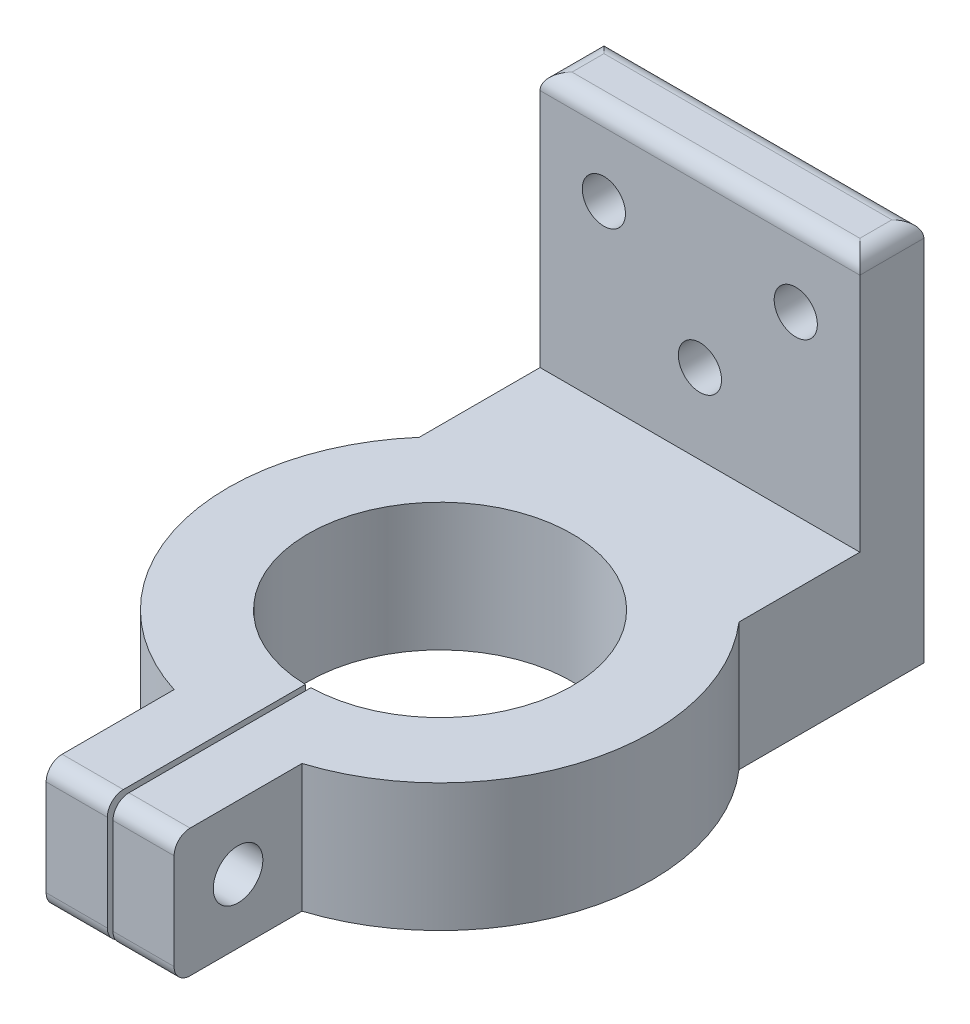
ISO-10303-21;
HEADER;
FILE_DESCRIPTION(('STEP AP214'),'2;1');
FILE_NAME('part.step','',(''),(''),'','','');
FILE_SCHEMA(('AUTOMOTIVE_DESIGN { 1 0 10303 214 1 1 1 1 }'));
ENDSEC;
DATA;
#1=APPLICATION_CONTEXT('core data for automotive mechanical design processes');
#2=APPLICATION_PROTOCOL_DEFINITION('international standard','automotive_design',2000,#1);
#3=PRODUCT_CONTEXT('',#1,'mechanical');
#4=PRODUCT('Part','Part','',(#3));
#5=PRODUCT_RELATED_PRODUCT_CATEGORY('part','',(#4));
#6=PRODUCT_DEFINITION_FORMATION('','',#4);
#7=PRODUCT_DEFINITION_CONTEXT('part definition',#1,'design');
#8=PRODUCT_DEFINITION('design','',#6,#7);
#9=PRODUCT_DEFINITION_SHAPE('','',#8);
#10=(LENGTH_UNIT() NAMED_UNIT(*) SI_UNIT(.MILLI.,.METRE.));
#11=(NAMED_UNIT(*) PLANE_ANGLE_UNIT() SI_UNIT($,.RADIAN.));
#12=(NAMED_UNIT(*) SI_UNIT($,.STERADIAN.) SOLID_ANGLE_UNIT());
#13=UNCERTAINTY_MEASURE_WITH_UNIT(LENGTH_MEASURE(1.E-05),#10,'distance_accuracy_value','');
#14=(GEOMETRIC_REPRESENTATION_CONTEXT(3) GLOBAL_UNCERTAINTY_ASSIGNED_CONTEXT((#13)) GLOBAL_UNIT_ASSIGNED_CONTEXT((#10,
#11,#12)) REPRESENTATION_CONTEXT('',''));
#15=CARTESIAN_POINT('',(0.,0.,0.));
#16=DIRECTION('',(0.,0.,1.));
#17=DIRECTION('',(1.,0.,0.));
#18=AXIS2_PLACEMENT_3D('',#15,#16,#17);
#19=CARTESIAN_POINT('',(-4.,-5.00000000000001,40.8818050966598));
#20=DIRECTION('',(0.,0.,1.));
#21=DIRECTION('',(1.,0.,0.));
#22=AXIS2_PLACEMENT_3D('',#19,#20,#21);
#23=PLANE('',#22);
#24=DIRECTION('',(0.,-1.,0.));
#25=VECTOR('',#24,1.);
#26=CARTESIAN_POINT('',(-4.,-5.00000000000001,40.8818050966598));
#27=LINE('',#26,#25);
#28=CARTESIAN_POINT('',(-4.,-6.00000000000001,40.8818050966598));
#29=VERTEX_POINT('',#28);
#30=CARTESIAN_POINT('',(-4.,-12.,40.8818050966598));
#31=VERTEX_POINT('',#30);
#32=EDGE_CURVE('E306',#29,#31,#27,.T.);
#33=ORIENTED_EDGE('',*,*,#32,.T.);
#34=DIRECTION('',(-1.,0.,0.));
#35=VECTOR('',#34,1.);
#36=CARTESIAN_POINT('',(-0.175000000000003,-12.,40.8818050966598));
#37=LINE('',#36,#35);
#38=CARTESIAN_POINT('',(-0.175000000000004,-12.,40.8818050966598));
#39=VERTEX_POINT('',#38);
#40=EDGE_CURVE('E436',#31,#39,#37,.F.);
#41=ORIENTED_EDGE('',*,*,#40,.T.);
#42=DIRECTION('',(0.,-1.,0.));
#43=VECTOR('',#42,1.);
#44=CARTESIAN_POINT('',(-0.175000000000004,-5.00000000000001,40.8818050966598));
#45=LINE('',#44,#43);
#46=CARTESIAN_POINT('',(-0.175000000000004,-6.00000000000001,40.8818050966598));
#47=VERTEX_POINT('',#46);
#48=EDGE_CURVE('E215',#47,#39,#45,.T.);
#49=ORIENTED_EDGE('',*,*,#48,.F.);
#50=DIRECTION('',(-1.,0.,0.));
#51=VECTOR('',#50,1.);
#52=CARTESIAN_POINT('',(-4.,-6.00000000000001,40.8818050966598));
#53=LINE('',#52,#51);
#54=EDGE_CURVE('E464',#47,#29,#53,.T.);
#55=ORIENTED_EDGE('',*,*,#54,.T.);
#56=EDGE_LOOP('',(#33,#41,#49,#55));
#57=FACE_BOUND('',#56,.T.);
#58=ADVANCED_FACE('F39',(#57),#23,.T.);
#59=CARTESIAN_POINT('',(0.,0.,4.));
#60=DIRECTION('',(0.,0.,1.));
#61=DIRECTION('',(1.,0.,0.));
#62=AXIS2_PLACEMENT_3D('',#59,#60,#61);
#63=PLANE('',#62);
#64=DIRECTION('',(0.,1.,0.));
#65=VECTOR('',#64,1.);
#66=CARTESIAN_POINT('',(10.,11.,4.));
#67=LINE('',#66,#65);
#68=CARTESIAN_POINT('',(10.,-5.00000000000001,4.));
#69=VERTEX_POINT('',#68);
#70=CARTESIAN_POINT('',(10.,9.99999999999999,4.));
#71=VERTEX_POINT('',#70);
#72=EDGE_CURVE('E360',#69,#71,#67,.T.);
#73=ORIENTED_EDGE('',*,*,#72,.T.);
#74=DIRECTION('',(-1.,0.,0.));
#75=VECTOR('',#74,1.);
#76=CARTESIAN_POINT('',(-10.,9.99999999999999,4.));
#77=LINE('',#76,#75);
#78=CARTESIAN_POINT('',(-10.,9.99999999999999,4.));
#79=VERTEX_POINT('',#78);
#80=EDGE_CURVE('E246',#71,#79,#77,.T.);
#81=ORIENTED_EDGE('',*,*,#80,.T.);
#82=DIRECTION('',(0.,-1.,0.));
#83=VECTOR('',#82,1.);
#84=CARTESIAN_POINT('',(-10.,11.,4.));
#85=LINE('',#84,#83);
#86=CARTESIAN_POINT('',(-10.,-5.00000000000001,4.));
#87=VERTEX_POINT('',#86);
#88=EDGE_CURVE('E357',#79,#87,#85,.T.);
#89=ORIENTED_EDGE('',*,*,#88,.T.);
#90=DIRECTION('',(-1.,0.,0.));
#91=VECTOR('',#90,1.);
#92=CARTESIAN_POINT('',(-10.,-5.00000000000001,4.));
#93=LINE('',#92,#91);
#94=EDGE_CURVE('E321',#69,#87,#93,.T.);
#95=ORIENTED_EDGE('',*,*,#94,.F.);
#96=EDGE_LOOP('',(#73,#81,#89,#95));
#97=FACE_BOUND('',#96,.T.);
#98=CARTESIAN_POINT('',(0.,0.,4.));
#99=DIRECTION('',(0.,0.,1.));
#100=DIRECTION('',(1.,0.,0.));
#101=AXIS2_PLACEMENT_3D('',#98,#99,#100);
#102=CIRCLE('',#101,1.35000000000001);
#103=CARTESIAN_POINT('',(1.35000000000001,0.,4.));
#104=VERTEX_POINT('',#103);
#105=EDGE_CURVE('E341',#104,#104,#102,.T.);
#106=ORIENTED_EDGE('',*,*,#105,.F.);
#107=EDGE_LOOP('',(#106));
#108=FACE_BOUND('',#107,.T.);
#109=CARTESIAN_POINT('',(5.99199679743745,5.99999999999999,4.));
#110=DIRECTION('',(0.,0.,1.));
#111=DIRECTION('',(1.,0.,0.));
#112=AXIS2_PLACEMENT_3D('',#109,#110,#111);
#113=CIRCLE('',#112,1.35000000000001);
#114=CARTESIAN_POINT('',(7.34199679743746,5.99999999999999,4.));
#115=VERTEX_POINT('',#114);
#116=EDGE_CURVE('E349',#115,#115,#113,.T.);
#117=ORIENTED_EDGE('',*,*,#116,.F.);
#118=EDGE_LOOP('',(#117));
#119=FACE_BOUND('',#118,.T.);
#120=CARTESIAN_POINT('',(-6.00800320256255,5.99999999999999,4.));
#121=DIRECTION('',(0.,0.,1.));
#122=DIRECTION('',(1.,0.,0.));
#123=AXIS2_PLACEMENT_3D('',#120,#121,#122);
#124=CIRCLE('',#123,1.35);
#125=CARTESIAN_POINT('',(-4.65800320256254,5.99999999999999,4.));
#126=VERTEX_POINT('',#125);
#127=EDGE_CURVE('E333',#126,#126,#124,.T.);
#128=ORIENTED_EDGE('',*,*,#127,.F.);
#129=EDGE_LOOP('',(#128));
#130=FACE_BOUND('',#129,.T.);
#131=ADVANCED_FACE('F510',(#97,#108,#119,#130),#63,.T.);
#132=CARTESIAN_POINT('',(0.,0.,0.));
#133=DIRECTION('',(0.,0.,1.));
#134=DIRECTION('',(1.,0.,0.));
#135=AXIS2_PLACEMENT_3D('',#132,#133,#134);
#136=PLANE('',#135);
#137=DIRECTION('',(0.,-1.,0.));
#138=VECTOR('',#137,1.);
#139=CARTESIAN_POINT('',(-10.,11.,0.));
#140=LINE('',#139,#138);
#141=CARTESIAN_POINT('',(-10.,9.99999999999999,0.));
#142=VERTEX_POINT('',#141);
#143=CARTESIAN_POINT('',(-10.,-13.,0.));
#144=VERTEX_POINT('',#143);
#145=EDGE_CURVE('E353',#142,#144,#140,.T.);
#146=ORIENTED_EDGE('',*,*,#145,.F.);
#147=DIRECTION('',(-1.,0.,0.));
#148=VECTOR('',#147,1.);
#149=CARTESIAN_POINT('',(0.,9.99999999999999,0.));
#150=LINE('',#149,#148);
#151=CARTESIAN_POINT('',(10.,9.99999999999999,0.));
#152=VERTEX_POINT('',#151);
#153=EDGE_CURVE('E252',#142,#152,#150,.F.);
#154=ORIENTED_EDGE('',*,*,#153,.T.);
#155=DIRECTION('',(0.,1.,0.));
#156=VECTOR('',#155,1.);
#157=CARTESIAN_POINT('',(10.,11.,0.));
#158=LINE('',#157,#156);
#159=CARTESIAN_POINT('',(10.,-13.,0.));
#160=VERTEX_POINT('',#159);
#161=EDGE_CURVE('E361',#160,#152,#158,.T.);
#162=ORIENTED_EDGE('',*,*,#161,.F.);
#163=DIRECTION('',(1.,0.,0.));
#164=VECTOR('',#163,1.);
#165=CARTESIAN_POINT('',(-10.,-13.,0.));
#166=LINE('',#165,#164);
#167=EDGE_CURVE('E368',#144,#160,#166,.T.);
#168=ORIENTED_EDGE('',*,*,#167,.F.);
#169=EDGE_LOOP('',(#146,#154,#162,#168));
#170=FACE_BOUND('',#169,.T.);
#171=CARTESIAN_POINT('',(5.99199679743745,5.99999999999999,0.));
#172=DIRECTION('',(0.,0.,1.));
#173=DIRECTION('',(1.,0.,0.));
#174=AXIS2_PLACEMENT_3D('',#171,#172,#173);
#175=CIRCLE('',#174,1.35000000000001);
#176=CARTESIAN_POINT('',(7.34199679743746,5.99999999999999,0.));
#177=VERTEX_POINT('',#176);
#178=EDGE_CURVE('E345',#177,#177,#175,.T.);
#179=ORIENTED_EDGE('',*,*,#178,.T.);
#180=EDGE_LOOP('',(#179));
#181=FACE_BOUND('',#180,.T.);
#182=CARTESIAN_POINT('',(0.,0.,0.));
#183=DIRECTION('',(0.,0.,1.));
#184=DIRECTION('',(1.,0.,0.));
#185=AXIS2_PLACEMENT_3D('',#182,#183,#184);
#186=CIRCLE('',#185,1.35000000000001);
#187=CARTESIAN_POINT('',(1.35000000000001,0.,0.));
#188=VERTEX_POINT('',#187);
#189=EDGE_CURVE('E337',#188,#188,#186,.T.);
#190=ORIENTED_EDGE('',*,*,#189,.T.);
#191=EDGE_LOOP('',(#190));
#192=FACE_BOUND('',#191,.T.);
#193=CARTESIAN_POINT('',(-6.00800320256255,5.99999999999999,0.));
#194=DIRECTION('',(0.,0.,1.));
#195=DIRECTION('',(1.,0.,0.));
#196=AXIS2_PLACEMENT_3D('',#193,#194,#195);
#197=CIRCLE('',#196,1.35);
#198=CARTESIAN_POINT('',(-4.65800320256254,5.99999999999999,0.));
#199=VERTEX_POINT('',#198);
#200=EDGE_CURVE('E332',#199,#199,#197,.T.);
#201=ORIENTED_EDGE('',*,*,#200,.T.);
#202=EDGE_LOOP('',(#201));
#203=FACE_BOUND('',#202,.T.);
#204=ADVANCED_FACE('F389',(#170,#181,#192,#203),#136,.F.);
#205=CARTESIAN_POINT('',(-10.,11.,4.));
#206=DIRECTION('',(1.,0.,0.));
#207=DIRECTION('',(0.,1.,0.));
#208=AXIS2_PLACEMENT_3D('',#205,#206,#207);
#209=PLANE('',#208);
#210=ORIENTED_EDGE('',*,*,#88,.F.);
#211=DIRECTION('',(0.,0.,-1.));
#212=VECTOR('',#211,1.);
#213=CARTESIAN_POINT('',(-10.,9.99999999999999,4.));
#214=LINE('',#213,#212);
#215=EDGE_CURVE('E249',#79,#142,#214,.T.);
#216=ORIENTED_EDGE('',*,*,#215,.T.);
#217=ORIENTED_EDGE('',*,*,#145,.T.);
#218=DIRECTION('',(0.,0.,-1.));
#219=VECTOR('',#218,1.);
#220=CARTESIAN_POINT('',(-10.,-13.,4.));
#221=LINE('',#220,#219);
#222=CARTESIAN_POINT('',(-10.,-13.,11.5573306746431));
#223=VERTEX_POINT('',#222);
#224=EDGE_CURVE('E232',#223,#144,#221,.T.);
#225=ORIENTED_EDGE('',*,*,#224,.F.);
#226=DIRECTION('',(0.,-1.,0.));
#227=VECTOR('',#226,1.);
#228=CARTESIAN_POINT('',(-10.,-5.00000000000001,11.5573306746431));
#229=LINE('',#228,#227);
#230=CARTESIAN_POINT('',(-10.,-5.00000000000001,11.5573306746431));
#231=VERTEX_POINT('',#230);
#232=EDGE_CURVE('E318',#223,#231,#229,.F.);
#233=ORIENTED_EDGE('',*,*,#232,.T.);
#234=DIRECTION('',(0.,0.,-1.));
#235=VECTOR('',#234,1.);
#236=CARTESIAN_POINT('',(-10.,-5.00000000000001,12.));
#237=LINE('',#236,#235);
#238=EDGE_CURVE('E325',#231,#87,#237,.T.);
#239=ORIENTED_EDGE('',*,*,#238,.T.);
#240=EDGE_LOOP('',(#210,#216,#217,#225,#233,#239));
#241=FACE_BOUND('',#240,.T.);
#242=ADVANCED_FACE('F506',(#241),#209,.F.);
#243=CARTESIAN_POINT('',(-10.,-13.,4.));
#244=DIRECTION('',(0.,1.,0.));
#245=DIRECTION('',(0.,0.,1.));
#246=AXIS2_PLACEMENT_3D('',#243,#244,#245);
#247=PLANE('',#246);
#248=DIRECTION('',(0.,0.,-1.));
#249=VECTOR('',#248,1.);
#250=CARTESIAN_POINT('',(-0.175000000000004,-13.,28.4981437305614));
#251=LINE('',#250,#249);
#252=CARTESIAN_POINT('',(-0.175000000000004,-13.,39.8818050966598));
#253=VERTEX_POINT('',#252);
#254=CARTESIAN_POINT('',(-0.175000000000022,-13.,28.4981437305614));
#255=VERTEX_POINT('',#254);
#256=EDGE_CURVE('E198',#253,#255,#251,.T.);
#257=ORIENTED_EDGE('',*,*,#256,.F.);
#258=DIRECTION('',(-1.,0.,0.));
#259=VECTOR('',#258,1.);
#260=CARTESIAN_POINT('',(-4.,-13.,39.8818050966598));
#261=LINE('',#260,#259);
#262=CARTESIAN_POINT('',(-4.,-13.,39.8818050966598));
#263=VERTEX_POINT('',#262);
#264=EDGE_CURVE('E472',#253,#263,#261,.T.);
#265=ORIENTED_EDGE('',*,*,#264,.T.);
#266=DIRECTION('',(0.,0.,-1.));
#267=VECTOR('',#266,1.);
#268=CARTESIAN_POINT('',(-4.,-13.,32.8818050966598));
#269=LINE('',#268,#267);
#270=CARTESIAN_POINT('',(-4.,-13.,32.8818050966598));
#271=VERTEX_POINT('',#270);
#272=EDGE_CURVE('E298',#263,#271,#269,.T.);
#273=ORIENTED_EDGE('',*,*,#272,.T.);
#274=CARTESIAN_POINT('',(0.,-13.,20.25));
#275=DIRECTION('',(0.,-1.,0.));
#276=DIRECTION('',(0.,0.,-1.));
#277=AXIS2_PLACEMENT_3D('',#274,#275,#276);
#278=CIRCLE('',#277,13.25);
#279=EDGE_CURVE('E213',#271,#223,#278,.T.);
#280=ORIENTED_EDGE('',*,*,#279,.T.);
#281=ORIENTED_EDGE('',*,*,#224,.T.);
#282=ORIENTED_EDGE('',*,*,#167,.T.);
#283=DIRECTION('',(0.,0.,-1.));
#284=VECTOR('',#283,1.);
#285=CARTESIAN_POINT('',(10.,-13.,4.));
#286=LINE('',#285,#284);
#287=CARTESIAN_POINT('',(10.,-13.,11.5573306746431));
#288=VERTEX_POINT('',#287);
#289=EDGE_CURVE('E365',#288,#160,#286,.T.);
#290=ORIENTED_EDGE('',*,*,#289,.F.);
#291=CARTESIAN_POINT('',(4.,-13.,32.8818050966598));
#292=VERTEX_POINT('',#291);
#293=EDGE_CURVE('E208',#288,#292,#278,.T.);
#294=ORIENTED_EDGE('',*,*,#293,.T.);
#295=DIRECTION('',(0.,0.,1.));
#296=VECTOR('',#295,1.);
#297=CARTESIAN_POINT('',(4.,-13.,32.8818050966598));
#298=LINE('',#297,#296);
#299=CARTESIAN_POINT('',(4.,-13.,39.8818050966598));
#300=VERTEX_POINT('',#299);
#301=EDGE_CURVE('E294',#292,#300,#298,.T.);
#302=ORIENTED_EDGE('',*,*,#301,.T.);
#303=DIRECTION('',(-1.,0.,0.));
#304=VECTOR('',#303,1.);
#305=CARTESIAN_POINT('',(0.175,-13.,39.8818050966598));
#306=LINE('',#305,#304);
#307=CARTESIAN_POINT('',(0.175,-13.,39.8818050966598));
#308=VERTEX_POINT('',#307);
#309=EDGE_CURVE('E255',#300,#308,#306,.T.);
#310=ORIENTED_EDGE('',*,*,#309,.T.);
#311=DIRECTION('',(0.,0.,1.));
#312=VECTOR('',#311,1.);
#313=CARTESIAN_POINT('',(0.175000000000004,-13.,28.4981437305614));
#314=LINE('',#313,#312);
#315=CARTESIAN_POINT('',(0.175000000000004,-13.,28.4981437305614));
#316=VERTEX_POINT('',#315);
#317=EDGE_CURVE('E191',#316,#308,#314,.T.);
#318=ORIENTED_EDGE('',*,*,#317,.F.);
#319=CARTESIAN_POINT('',(0.,-13.,20.25));
#320=DIRECTION('',(0.,-1.,0.));
#321=DIRECTION('',(0.,0.,-1.));
#322=AXIS2_PLACEMENT_3D('',#319,#320,#321);
#323=CIRCLE('',#322,8.25);
#324=EDGE_CURVE('E209',#255,#316,#323,.T.);
#325=ORIENTED_EDGE('',*,*,#324,.F.);
#326=EDGE_LOOP('',(#257,#265,#273,#280,#281,#282,#290,#294,#302,#310,#318,#325));
#327=FACE_BOUND('',#326,.T.);
#328=ADVANCED_FACE('F381',(#327),#247,.F.);
#329=CARTESIAN_POINT('',(10.,11.,4.));
#330=DIRECTION('',(-1.,0.,0.));
#331=DIRECTION('',(0.,-1.,0.));
#332=AXIS2_PLACEMENT_3D('',#329,#330,#331);
#333=PLANE('',#332);
#334=ORIENTED_EDGE('',*,*,#161,.T.);
#335=DIRECTION('',(0.,0.,-1.));
#336=VECTOR('',#335,1.);
#337=CARTESIAN_POINT('',(10.,9.99999999999999,4.));
#338=LINE('',#337,#336);
#339=EDGE_CURVE('E242',#152,#71,#338,.F.);
#340=ORIENTED_EDGE('',*,*,#339,.T.);
#341=ORIENTED_EDGE('',*,*,#72,.F.);
#342=DIRECTION('',(0.,0.,-1.));
#343=VECTOR('',#342,1.);
#344=CARTESIAN_POINT('',(10.,-5.00000000000001,12.));
#345=LINE('',#344,#343);
#346=CARTESIAN_POINT('',(10.,-5.00000000000001,11.5573306746431));
#347=VERTEX_POINT('',#346);
#348=EDGE_CURVE('E329',#347,#69,#345,.T.);
#349=ORIENTED_EDGE('',*,*,#348,.F.);
#350=DIRECTION('',(0.,-1.,0.));
#351=VECTOR('',#350,1.);
#352=CARTESIAN_POINT('',(10.,-5.00000000000001,11.5573306746431));
#353=LINE('',#352,#351);
#354=EDGE_CURVE('E305',#347,#288,#353,.T.);
#355=ORIENTED_EDGE('',*,*,#354,.T.);
#356=ORIENTED_EDGE('',*,*,#289,.T.);
#357=EDGE_LOOP('',(#334,#340,#341,#349,#355,#356));
#358=FACE_BOUND('',#357,.T.);
#359=ADVANCED_FACE('F395',(#358),#333,.F.);
#360=CARTESIAN_POINT('',(-10.,11.,4.));
#361=DIRECTION('',(0.,-1.,0.));
#362=DIRECTION('',(0.,0.,-1.));
#363=AXIS2_PLACEMENT_3D('',#360,#361,#362);
#364=PLANE('',#363);
#365=DIRECTION('',(-1.,0.,0.));
#366=VECTOR('',#365,1.);
#367=CARTESIAN_POINT('',(10.,11.,3.));
#368=LINE('',#367,#366);
#369=CARTESIAN_POINT('',(-9.,11.,3.));
#370=VERTEX_POINT('',#369);
#371=CARTESIAN_POINT('',(9.,11.,3.));
#372=VERTEX_POINT('',#371);
#373=EDGE_CURVE('E235',#370,#372,#368,.F.);
#374=ORIENTED_EDGE('',*,*,#373,.T.);
#375=DIRECTION('',(0.,0.,-1.));
#376=VECTOR('',#375,1.);
#377=CARTESIAN_POINT('',(9.,11.,4.));
#378=LINE('',#377,#376);
#379=CARTESIAN_POINT('',(9.,11.,1.));
#380=VERTEX_POINT('',#379);
#381=EDGE_CURVE('E238',#372,#380,#378,.T.);
#382=ORIENTED_EDGE('',*,*,#381,.T.);
#383=DIRECTION('',(-1.,0.,0.));
#384=VECTOR('',#383,1.);
#385=CARTESIAN_POINT('',(-10.,11.,1.));
#386=LINE('',#385,#384);
#387=CARTESIAN_POINT('',(-9.,11.,1.));
#388=VERTEX_POINT('',#387);
#389=EDGE_CURVE('E228',#380,#388,#386,.T.);
#390=ORIENTED_EDGE('',*,*,#389,.T.);
#391=DIRECTION('',(0.,0.,-1.));
#392=VECTOR('',#391,1.);
#393=CARTESIAN_POINT('',(-9.,11.,4.));
#394=LINE('',#393,#392);
#395=EDGE_CURVE('E231',#388,#370,#394,.F.);
#396=ORIENTED_EDGE('',*,*,#395,.T.);
#397=EDGE_LOOP('',(#374,#382,#390,#396));
#398=FACE_BOUND('',#397,.T.);
#399=ADVANCED_FACE('F627',(#398),#364,.F.);
#400=CARTESIAN_POINT('',(5.99199679743745,5.99999999999999,4.));
#401=DIRECTION('',(0.,0.,-1.));
#402=DIRECTION('',(-1.,0.,0.));
#403=AXIS2_PLACEMENT_3D('',#400,#401,#402);
#404=CYLINDRICAL_SURFACE('',#403,1.35000000000001);
#405=ORIENTED_EDGE('',*,*,#116,.T.);
#406=EDGE_LOOP('',(#405));
#407=FACE_BOUND('',#406,.T.);
#408=ORIENTED_EDGE('',*,*,#178,.F.);
#409=EDGE_LOOP('',(#408));
#410=FACE_BOUND('',#409,.T.);
#411=ADVANCED_FACE('F632',(#407,#410),#404,.F.);
#412=CARTESIAN_POINT('',(0.,0.,4.));
#413=DIRECTION('',(0.,0.,-1.));
#414=DIRECTION('',(-1.,0.,0.));
#415=AXIS2_PLACEMENT_3D('',#412,#413,#414);
#416=CYLINDRICAL_SURFACE('',#415,1.35000000000001);
#417=ORIENTED_EDGE('',*,*,#105,.T.);
#418=EDGE_LOOP('',(#417));
#419=FACE_BOUND('',#418,.T.);
#420=ORIENTED_EDGE('',*,*,#189,.F.);
#421=EDGE_LOOP('',(#420));
#422=FACE_BOUND('',#421,.T.);
#423=ADVANCED_FACE('F744',(#419,#422),#416,.F.);
#424=CARTESIAN_POINT('',(-6.00800320256255,5.99999999999999,4.));
#425=DIRECTION('',(0.,0.,-1.));
#426=DIRECTION('',(-1.,0.,0.));
#427=AXIS2_PLACEMENT_3D('',#424,#425,#426);
#428=CYLINDRICAL_SURFACE('',#427,1.35);
#429=ORIENTED_EDGE('',*,*,#127,.T.);
#430=EDGE_LOOP('',(#429));
#431=FACE_BOUND('',#430,.T.);
#432=ORIENTED_EDGE('',*,*,#200,.F.);
#433=EDGE_LOOP('',(#432));
#434=FACE_BOUND('',#433,.T.);
#435=ADVANCED_FACE('F617',(#431,#434),#428,.F.);
#436=CARTESIAN_POINT('',(-10.,-5.00000000000001,12.));
#437=DIRECTION('',(0.,-1.,0.));
#438=DIRECTION('',(1.,0.,0.));
#439=AXIS2_PLACEMENT_3D('',#436,#437,#438);
#440=PLANE('',#439);
#441=DIRECTION('',(0.,0.,-1.));
#442=VECTOR('',#441,1.);
#443=CARTESIAN_POINT('',(-4.,-5.00000000000001,32.8818050966598));
#444=LINE('',#443,#442);
#445=CARTESIAN_POINT('',(-4.,-5.00000000000001,39.8818050966598));
#446=VERTEX_POINT('',#445);
#447=CARTESIAN_POINT('',(-4.,-5.00000000000001,32.8818050966598));
#448=VERTEX_POINT('',#447);
#449=EDGE_CURVE('E288',#446,#448,#444,.T.);
#450=ORIENTED_EDGE('',*,*,#449,.F.);
#451=DIRECTION('',(-1.,0.,0.));
#452=VECTOR('',#451,1.);
#453=CARTESIAN_POINT('',(-0.175000000000004,-5.00000000000001,39.8818050966598));
#454=LINE('',#453,#452);
#455=CARTESIAN_POINT('',(-0.175000000000004,-5.00000000000001,39.8818050966598));
#456=VERTEX_POINT('',#455);
#457=EDGE_CURVE('E11',#446,#456,#454,.F.);
#458=ORIENTED_EDGE('',*,*,#457,.T.);
#459=DIRECTION('',(0.,0.,-1.));
#460=VECTOR('',#459,1.);
#461=CARTESIAN_POINT('',(-0.175000000000004,-5.00000000000001,28.4981437305614));
#462=LINE('',#461,#460);
#463=CARTESIAN_POINT('',(-0.175000000000004,-5.00000000000001,28.4981437305614));
#464=VERTEX_POINT('',#463);
#465=EDGE_CURVE('E180',#456,#464,#462,.T.);
#466=ORIENTED_EDGE('',*,*,#465,.T.);
#467=CARTESIAN_POINT('',(0.,-5.00000000000001,20.25));
#468=DIRECTION('',(0.,-1.,0.));
#469=DIRECTION('',(0.,0.,-1.));
#470=AXIS2_PLACEMENT_3D('',#467,#468,#469);
#471=CIRCLE('',#470,8.25);
#472=CARTESIAN_POINT('',(0.175000000000004,-5.00000000000001,28.4981437305614));
#473=VERTEX_POINT('',#472);
#474=EDGE_CURVE('E185',#464,#473,#471,.T.);
#475=ORIENTED_EDGE('',*,*,#474,.T.);
#476=DIRECTION('',(0.,0.,1.));
#477=VECTOR('',#476,1.);
#478=CARTESIAN_POINT('',(0.175000000000004,-5.00000000000001,28.4981437305614));
#479=LINE('',#478,#477);
#480=CARTESIAN_POINT('',(0.175,-5.00000000000001,39.8818050966598));
#481=VERTEX_POINT('',#480);
#482=EDGE_CURVE('E190',#473,#481,#479,.T.);
#483=ORIENTED_EDGE('',*,*,#482,.T.);
#484=DIRECTION('',(-1.,0.,0.));
#485=VECTOR('',#484,1.);
#486=CARTESIAN_POINT('',(4.,-5.00000000000001,39.8818050966598));
#487=LINE('',#486,#485);
#488=CARTESIAN_POINT('',(4.,-5.00000000000001,39.8818050966598));
#489=VERTEX_POINT('',#488);
#490=EDGE_CURVE('E49',#481,#489,#487,.F.);
#491=ORIENTED_EDGE('',*,*,#490,.T.);
#492=DIRECTION('',(0.,0.,1.));
#493=VECTOR('',#492,1.);
#494=CARTESIAN_POINT('',(4.,-5.00000000000001,32.8818050966598));
#495=LINE('',#494,#493);
#496=CARTESIAN_POINT('',(4.,-5.00000000000001,32.8818050966598));
#497=VERTEX_POINT('',#496);
#498=EDGE_CURVE('E284',#497,#489,#495,.T.);
#499=ORIENTED_EDGE('',*,*,#498,.F.);
#500=CARTESIAN_POINT('',(0.,-5.00000000000001,20.25));
#501=DIRECTION('',(0.,-1.,0.));
#502=DIRECTION('',(0.,0.,-1.));
#503=AXIS2_PLACEMENT_3D('',#500,#501,#502);
#504=CIRCLE('',#503,13.25);
#505=EDGE_CURVE('E285',#347,#497,#504,.T.);
#506=ORIENTED_EDGE('',*,*,#505,.F.);
#507=ORIENTED_EDGE('',*,*,#348,.T.);
#508=ORIENTED_EDGE('',*,*,#94,.T.);
#509=ORIENTED_EDGE('',*,*,#238,.F.);
#510=EDGE_CURVE('E280',#448,#231,#504,.T.);
#511=ORIENTED_EDGE('',*,*,#510,.F.);
#512=EDGE_LOOP('',(#450,#458,#466,#475,#483,#491,#499,#506,#507,#508,#509,#511));
#513=FACE_BOUND('',#512,.T.);
#514=ADVANCED_FACE('F183',(#513),#440,.F.);
#515=CARTESIAN_POINT('',(0.,-5.00000000000001,20.25));
#516=DIRECTION('',(0.,-1.,0.));
#517=DIRECTION('',(0.,0.,-1.));
#518=AXIS2_PLACEMENT_3D('',#515,#516,#517);
#519=CYLINDRICAL_SURFACE('',#518,13.25);
#520=ORIENTED_EDGE('',*,*,#232,.F.);
#521=ORIENTED_EDGE('',*,*,#279,.F.);
#522=DIRECTION('',(0.,-1.,0.));
#523=VECTOR('',#522,1.);
#524=CARTESIAN_POINT('',(-4.,-5.00000000000001,32.8818050966598));
#525=LINE('',#524,#523);
#526=EDGE_CURVE('E301',#448,#271,#525,.T.);
#527=ORIENTED_EDGE('',*,*,#526,.F.);
#528=ORIENTED_EDGE('',*,*,#510,.T.);
#529=EDGE_LOOP('',(#520,#521,#527,#528));
#530=FACE_BOUND('',#529,.T.);
#531=ADVANCED_FACE('F503',(#530),#519,.T.);
#532=ORIENTED_EDGE('',*,*,#354,.F.);
#533=ORIENTED_EDGE('',*,*,#505,.T.);
#534=DIRECTION('',(0.,-1.,0.));
#535=VECTOR('',#534,1.);
#536=CARTESIAN_POINT('',(4.,-5.00000000000001,32.8818050966598));
#537=LINE('',#536,#535);
#538=EDGE_CURVE('E290',#497,#292,#537,.T.);
#539=ORIENTED_EDGE('',*,*,#538,.T.);
#540=ORIENTED_EDGE('',*,*,#293,.F.);
#541=EDGE_LOOP('',(#532,#533,#539,#540));
#542=FACE_BOUND('',#541,.T.);
#543=ADVANCED_FACE('F515',(#542),#519,.T.);
#544=CARTESIAN_POINT('',(-4.,-5.00000000000001,32.8818050966598));
#545=DIRECTION('',(-1.,0.,0.));
#546=DIRECTION('',(0.,0.,1.));
#547=AXIS2_PLACEMENT_3D('',#544,#545,#546);
#548=PLANE('',#547);
#549=CARTESIAN_POINT('',(-4.,-9.00000000000001,36.8818050966598));
#550=DIRECTION('',(1.,0.,0.));
#551=DIRECTION('',(0.,0.,-1.));
#552=AXIS2_PLACEMENT_3D('',#549,#550,#551);
#553=CIRCLE('',#552,1.55);
#554=CARTESIAN_POINT('',(-4.,-9.00000000000001,35.3318050966598));
#555=VERTEX_POINT('',#554);
#556=EDGE_CURVE('E227',#555,#555,#553,.T.);
#557=ORIENTED_EDGE('',*,*,#556,.T.);
#558=EDGE_LOOP('',(#557));
#559=FACE_BOUND('',#558,.T.);
#560=ORIENTED_EDGE('',*,*,#272,.F.);
#561=CARTESIAN_POINT('',(-4.,-12.,39.8818050966598));
#562=DIRECTION('',(-1.,0.,0.));
#563=DIRECTION('',(0.,0.,1.));
#564=AXIS2_PLACEMENT_3D('',#561,#562,#563);
#565=CIRCLE('',#564,1.);
#566=EDGE_CURVE('E467',#263,#31,#565,.T.);
#567=ORIENTED_EDGE('',*,*,#566,.T.);
#568=ORIENTED_EDGE('',*,*,#32,.F.);
#569=CARTESIAN_POINT('',(-4.,-6.00000000000001,39.8818050966598));
#570=DIRECTION('',(-1.,0.,0.));
#571=DIRECTION('',(0.,0.,1.));
#572=AXIS2_PLACEMENT_3D('',#569,#570,#571);
#573=CIRCLE('',#572,1.);
#574=EDGE_CURVE('E469',#29,#446,#573,.T.);
#575=ORIENTED_EDGE('',*,*,#574,.T.);
#576=ORIENTED_EDGE('',*,*,#449,.T.);
#577=ORIENTED_EDGE('',*,*,#526,.T.);
#578=EDGE_LOOP('',(#560,#567,#568,#575,#576,#577));
#579=FACE_BOUND('',#578,.T.);
#580=ADVANCED_FACE('F498',(#559,#579),#548,.T.);
#581=DIRECTION('',(0.,1.,0.));
#582=VECTOR('',#581,1.);
#583=CARTESIAN_POINT('',(0.175,-5.00000000000001,40.8818050966598));
#584=LINE('',#583,#582);
#585=CARTESIAN_POINT('',(0.175,-12.,40.8818050966598));
#586=VERTEX_POINT('',#585);
#587=CARTESIAN_POINT('',(0.175,-6.00000000000001,40.8818050966598));
#588=VERTEX_POINT('',#587);
#589=EDGE_CURVE('E267',#586,#588,#584,.T.);
#590=ORIENTED_EDGE('',*,*,#589,.F.);
#591=DIRECTION('',(-1.,0.,0.));
#592=VECTOR('',#591,1.);
#593=CARTESIAN_POINT('',(4.,-12.,40.8818050966598));
#594=LINE('',#593,#592);
#595=CARTESIAN_POINT('',(4.,-12.,40.8818050966598));
#596=VERTEX_POINT('',#595);
#597=EDGE_CURVE('E64',#586,#596,#594,.F.);
#598=ORIENTED_EDGE('',*,*,#597,.T.);
#599=DIRECTION('',(0.,-1.,0.));
#600=VECTOR('',#599,1.);
#601=CARTESIAN_POINT('',(4.,-5.00000000000001,40.8818050966598));
#602=LINE('',#601,#600);
#603=CARTESIAN_POINT('',(4.,-6.00000000000001,40.8818050966598));
#604=VERTEX_POINT('',#603);
#605=EDGE_CURVE('E310',#604,#596,#602,.T.);
#606=ORIENTED_EDGE('',*,*,#605,.F.);
#607=DIRECTION('',(-1.,0.,0.));
#608=VECTOR('',#607,1.);
#609=CARTESIAN_POINT('',(0.174999999999999,-6.00000000000001,40.8818050966598));
#610=LINE('',#609,#608);
#611=EDGE_CURVE('E450',#604,#588,#610,.T.);
#612=ORIENTED_EDGE('',*,*,#611,.T.);
#613=EDGE_LOOP('',(#590,#598,#606,#612));
#614=FACE_BOUND('',#613,.T.);
#615=ADVANCED_FACE('F523',(#614),#23,.T.);
#616=CARTESIAN_POINT('',(4.,-5.00000000000001,32.8818050966598));
#617=DIRECTION('',(1.,0.,0.));
#618=DIRECTION('',(0.,0.,-1.));
#619=AXIS2_PLACEMENT_3D('',#616,#617,#618);
#620=PLANE('',#619);
#621=CARTESIAN_POINT('',(4.,-9.00000000000001,36.8818050966598));
#622=DIRECTION('',(1.,0.,0.));
#623=DIRECTION('',(0.,0.,-1.));
#624=AXIS2_PLACEMENT_3D('',#621,#622,#623);
#625=CIRCLE('',#624,1.55);
#626=CARTESIAN_POINT('',(4.,-9.00000000000001,35.3318050966598));
#627=VERTEX_POINT('',#626);
#628=EDGE_CURVE('E418',#627,#627,#625,.T.);
#629=ORIENTED_EDGE('',*,*,#628,.F.);
#630=EDGE_LOOP('',(#629));
#631=FACE_BOUND('',#630,.T.);
#632=ORIENTED_EDGE('',*,*,#605,.T.);
#633=CARTESIAN_POINT('',(4.,-12.,39.8818050966598));
#634=DIRECTION('',(1.,0.,0.));
#635=DIRECTION('',(0.,0.,-1.));
#636=AXIS2_PLACEMENT_3D('',#633,#634,#635);
#637=CIRCLE('',#636,1.);
#638=EDGE_CURVE('E459',#596,#300,#637,.T.);
#639=ORIENTED_EDGE('',*,*,#638,.T.);
#640=ORIENTED_EDGE('',*,*,#301,.F.);
#641=ORIENTED_EDGE('',*,*,#538,.F.);
#642=ORIENTED_EDGE('',*,*,#498,.T.);
#643=CARTESIAN_POINT('',(4.,-6.00000000000001,39.8818050966598));
#644=DIRECTION('',(1.,0.,0.));
#645=DIRECTION('',(0.,0.,-1.));
#646=AXIS2_PLACEMENT_3D('',#643,#644,#645);
#647=CIRCLE('',#646,1.);
#648=EDGE_CURVE('E456',#489,#604,#647,.T.);
#649=ORIENTED_EDGE('',*,*,#648,.T.);
#650=EDGE_LOOP('',(#632,#639,#640,#641,#642,#649));
#651=FACE_BOUND('',#650,.T.);
#652=ADVANCED_FACE('F520',(#631,#651),#620,.T.);
#653=CARTESIAN_POINT('',(0.,-5.00000000000001,20.25));
#654=DIRECTION('',(0.,-1.,0.));
#655=DIRECTION('',(0.,0.,-1.));
#656=AXIS2_PLACEMENT_3D('',#653,#654,#655);
#657=CYLINDRICAL_SURFACE('',#656,8.25);
#658=ORIENTED_EDGE('',*,*,#324,.T.);
#659=DIRECTION('',(0.,-1.,0.));
#660=VECTOR('',#659,1.);
#661=CARTESIAN_POINT('',(0.175000000000004,-5.00000000000001,28.4981437305614));
#662=LINE('',#661,#660);
#663=EDGE_CURVE('E203',#473,#316,#662,.T.);
#664=ORIENTED_EDGE('',*,*,#663,.F.);
#665=ORIENTED_EDGE('',*,*,#474,.F.);
#666=DIRECTION('',(0.,-1.,0.));
#667=VECTOR('',#666,1.);
#668=CARTESIAN_POINT('',(-0.175000000000004,-5.00000000000001,28.4981437305614));
#669=LINE('',#668,#667);
#670=EDGE_CURVE('E194',#464,#255,#669,.T.);
#671=ORIENTED_EDGE('',*,*,#670,.T.);
#672=EDGE_LOOP('',(#658,#664,#665,#671));
#673=FACE_BOUND('',#672,.T.);
#674=ADVANCED_FACE('F206',(#673),#657,.F.);
#675=CARTESIAN_POINT('',(-0.175000000000004,-5.00000000000001,28.4981437305614));
#676=DIRECTION('',(-1.,0.,0.));
#677=DIRECTION('',(0.,0.,1.));
#678=AXIS2_PLACEMENT_3D('',#675,#676,#677);
#679=PLANE('',#678);
#680=CARTESIAN_POINT('',(-0.175000000000004,-9.00000000000001,36.8818050966598));
#681=DIRECTION('',(-1.,0.,0.));
#682=DIRECTION('',(0.,0.,1.));
#683=AXIS2_PLACEMENT_3D('',#680,#681,#682);
#684=CIRCLE('',#683,1.55);
#685=CARTESIAN_POINT('',(-0.175000000000004,-9.00000000000001,38.4318050966598));
#686=VERTEX_POINT('',#685);
#687=EDGE_CURVE('E226',#686,#686,#684,.T.);
#688=ORIENTED_EDGE('',*,*,#687,.T.);
#689=EDGE_LOOP('',(#688));
#690=FACE_BOUND('',#689,.T.);
#691=ORIENTED_EDGE('',*,*,#48,.T.);
#692=CARTESIAN_POINT('',(-0.175000000000003,-12.,39.8818050966598));
#693=DIRECTION('',(-1.,0.,0.));
#694=DIRECTION('',(0.,0.,1.));
#695=AXIS2_PLACEMENT_3D('',#692,#693,#694);
#696=CIRCLE('',#695,1.);
#697=EDGE_CURVE('E441',#39,#253,#696,.F.);
#698=ORIENTED_EDGE('',*,*,#697,.T.);
#699=ORIENTED_EDGE('',*,*,#256,.T.);
#700=ORIENTED_EDGE('',*,*,#670,.F.);
#701=ORIENTED_EDGE('',*,*,#465,.F.);
#702=CARTESIAN_POINT('',(-0.175000000000004,-6.00000000000001,39.8818050966598));
#703=DIRECTION('',(-1.,0.,0.));
#704=DIRECTION('',(0.,0.,1.));
#705=AXIS2_PLACEMENT_3D('',#702,#703,#704);
#706=CIRCLE('',#705,1.);
#707=EDGE_CURVE('E438',#456,#47,#706,.F.);
#708=ORIENTED_EDGE('',*,*,#707,.T.);
#709=EDGE_LOOP('',(#691,#698,#699,#700,#701,#708));
#710=FACE_BOUND('',#709,.T.);
#711=ADVANCED_FACE('F196',(#690,#710),#679,.F.);
#712=CARTESIAN_POINT('',(0.175000000000004,-5.00000000000001,28.4981437305614));
#713=DIRECTION('',(1.,0.,0.));
#714=DIRECTION('',(0.,0.,-1.));
#715=AXIS2_PLACEMENT_3D('',#712,#713,#714);
#716=PLANE('',#715);
#717=CARTESIAN_POINT('',(0.175000000000001,-9.00000000000001,36.8818050966598));
#718=DIRECTION('',(1.,0.,0.));
#719=DIRECTION('',(0.,0.,-1.));
#720=AXIS2_PLACEMENT_3D('',#717,#718,#719);
#721=CIRCLE('',#720,1.55);
#722=CARTESIAN_POINT('',(0.175000000000001,-9.00000000000001,35.3318050966598));
#723=VERTEX_POINT('',#722);
#724=EDGE_CURVE('E222',#723,#723,#721,.T.);
#725=ORIENTED_EDGE('',*,*,#724,.T.);
#726=EDGE_LOOP('',(#725));
#727=FACE_BOUND('',#726,.T.);
#728=ORIENTED_EDGE('',*,*,#317,.T.);
#729=CARTESIAN_POINT('',(0.175,-12.,39.8818050966598));
#730=DIRECTION('',(1.,0.,0.));
#731=DIRECTION('',(0.,0.,-1.));
#732=AXIS2_PLACEMENT_3D('',#729,#730,#731);
#733=CIRCLE('',#732,1.);
#734=EDGE_CURVE('E447',#308,#586,#733,.F.);
#735=ORIENTED_EDGE('',*,*,#734,.T.);
#736=ORIENTED_EDGE('',*,*,#589,.T.);
#737=CARTESIAN_POINT('',(0.175,-6.00000000000001,39.8818050966598));
#738=DIRECTION('',(1.,0.,0.));
#739=DIRECTION('',(0.,0.,-1.));
#740=AXIS2_PLACEMENT_3D('',#737,#738,#739);
#741=CIRCLE('',#740,1.);
#742=EDGE_CURVE('E444',#588,#481,#741,.F.);
#743=ORIENTED_EDGE('',*,*,#742,.T.);
#744=ORIENTED_EDGE('',*,*,#482,.F.);
#745=ORIENTED_EDGE('',*,*,#663,.T.);
#746=EDGE_LOOP('',(#728,#735,#736,#743,#744,#745));
#747=FACE_BOUND('',#746,.T.);
#748=ADVANCED_FACE('F483',(#727,#747),#716,.F.);
#749=CARTESIAN_POINT('',(-4.,-9.00000000000001,36.8818050966598));
#750=DIRECTION('',(1.,0.,0.));
#751=DIRECTION('',(0.,0.,-1.));
#752=AXIS2_PLACEMENT_3D('',#749,#750,#751);
#753=CYLINDRICAL_SURFACE('',#752,1.55);
#754=ORIENTED_EDGE('',*,*,#628,.T.);
#755=EDGE_LOOP('',(#754));
#756=FACE_BOUND('',#755,.T.);
#757=ORIENTED_EDGE('',*,*,#724,.F.);
#758=EDGE_LOOP('',(#757));
#759=FACE_BOUND('',#758,.T.);
#760=ADVANCED_FACE('F561',(#756,#759),#753,.F.);
#761=ORIENTED_EDGE('',*,*,#556,.F.);
#762=EDGE_LOOP('',(#761));
#763=FACE_BOUND('',#762,.T.);
#764=ORIENTED_EDGE('',*,*,#687,.F.);
#765=EDGE_LOOP('',(#764));
#766=FACE_BOUND('',#765,.T.);
#767=ADVANCED_FACE('F563',(#763,#766),#753,.F.);
#768=CARTESIAN_POINT('',(-9.,9.99999999999999,4.));
#769=DIRECTION('',(0.,0.,-1.));
#770=DIRECTION('',(-1.,0.,0.));
#771=AXIS2_PLACEMENT_3D('',#768,#769,#770);
#772=CYLINDRICAL_SURFACE('',#771,1.);
#773=CARTESIAN_POINT('',(-9.,9.99999999999999,1.));
#774=DIRECTION('',(-0.707106781186547,0.,0.707106781186547));
#775=DIRECTION('',(-0.707106781186547,0.,-0.707106781186547));
#776=AXIS2_PLACEMENT_3D('',#773,#774,#775);
#777=ELLIPSE('',#776,1.41421356237309,1.);
#778=EDGE_CURVE('E412',#142,#388,#777,.F.);
#779=ORIENTED_EDGE('',*,*,#778,.F.);
#780=ORIENTED_EDGE('',*,*,#215,.F.);
#781=CARTESIAN_POINT('',(-9.,9.99999999999999,3.));
#782=DIRECTION('',(-0.707106781186547,0.,-0.707106781186547));
#783=DIRECTION('',(0.707106781186547,0.,-0.707106781186547));
#784=AXIS2_PLACEMENT_3D('',#781,#782,#783);
#785=ELLIPSE('',#784,1.41421356237309,1.);
#786=EDGE_CURVE('E43',#370,#79,#785,.F.);
#787=ORIENTED_EDGE('',*,*,#786,.F.);
#788=ORIENTED_EDGE('',*,*,#395,.F.);
#789=EDGE_LOOP('',(#779,#780,#787,#788));
#790=FACE_BOUND('',#789,.T.);
#791=ADVANCED_FACE('F565',(#790),#772,.T.);
#792=CARTESIAN_POINT('',(0.,9.99999999999999,3.));
#793=DIRECTION('',(1.,0.,0.));
#794=DIRECTION('',(0.,0.,-1.));
#795=AXIS2_PLACEMENT_3D('',#792,#793,#794);
#796=CYLINDRICAL_SURFACE('',#795,1.);
#797=ORIENTED_EDGE('',*,*,#786,.T.);
#798=ORIENTED_EDGE('',*,*,#80,.F.);
#799=CARTESIAN_POINT('',(9.,9.99999999999999,3.));
#800=DIRECTION('',(0.707106781186547,0.,-0.707106781186547));
#801=DIRECTION('',(0.707106781186547,0.,0.707106781186547));
#802=AXIS2_PLACEMENT_3D('',#799,#800,#801);
#803=ELLIPSE('',#802,1.41421356237309,1.);
#804=EDGE_CURVE('E404',#372,#71,#803,.T.);
#805=ORIENTED_EDGE('',*,*,#804,.F.);
#806=ORIENTED_EDGE('',*,*,#373,.F.);
#807=EDGE_LOOP('',(#797,#798,#805,#806));
#808=FACE_BOUND('',#807,.T.);
#809=ADVANCED_FACE('F571',(#808),#796,.T.);
#810=CARTESIAN_POINT('',(-10.,9.99999999999999,1.));
#811=DIRECTION('',(-1.,0.,0.));
#812=DIRECTION('',(0.,0.,1.));
#813=AXIS2_PLACEMENT_3D('',#810,#811,#812);
#814=CYLINDRICAL_SURFACE('',#813,1.);
#815=ORIENTED_EDGE('',*,*,#778,.T.);
#816=ORIENTED_EDGE('',*,*,#389,.F.);
#817=CARTESIAN_POINT('',(9.,9.99999999999999,1.));
#818=DIRECTION('',(-0.707106781186547,0.,-0.707106781186547));
#819=DIRECTION('',(-0.707106781186547,0.,0.707106781186547));
#820=AXIS2_PLACEMENT_3D('',#817,#818,#819);
#821=ELLIPSE('',#820,1.41421356237309,1.);
#822=EDGE_CURVE('E401',#152,#380,#821,.F.);
#823=ORIENTED_EDGE('',*,*,#822,.F.);
#824=ORIENTED_EDGE('',*,*,#153,.F.);
#825=EDGE_LOOP('',(#815,#816,#823,#824));
#826=FACE_BOUND('',#825,.T.);
#827=ADVANCED_FACE('F408',(#826),#814,.T.);
#828=CARTESIAN_POINT('',(9.,9.99999999999999,4.));
#829=DIRECTION('',(0.,0.,-1.));
#830=DIRECTION('',(-1.,0.,0.));
#831=AXIS2_PLACEMENT_3D('',#828,#829,#830);
#832=CYLINDRICAL_SURFACE('',#831,1.);
#833=ORIENTED_EDGE('',*,*,#804,.T.);
#834=ORIENTED_EDGE('',*,*,#339,.F.);
#835=ORIENTED_EDGE('',*,*,#822,.T.);
#836=ORIENTED_EDGE('',*,*,#381,.F.);
#837=EDGE_LOOP('',(#833,#834,#835,#836));
#838=FACE_BOUND('',#837,.T.);
#839=ADVANCED_FACE('F399',(#838),#832,.T.);
#840=CARTESIAN_POINT('',(-10.,-12.,39.8818050966598));
#841=DIRECTION('',(1.,0.,0.));
#842=DIRECTION('',(0.,0.,-1.));
#843=AXIS2_PLACEMENT_3D('',#840,#841,#842);
#844=CYLINDRICAL_SURFACE('',#843,1.);
#845=ORIENTED_EDGE('',*,*,#697,.F.);
#846=ORIENTED_EDGE('',*,*,#40,.F.);
#847=ORIENTED_EDGE('',*,*,#566,.F.);
#848=ORIENTED_EDGE('',*,*,#264,.F.);
#849=EDGE_LOOP('',(#845,#846,#847,#848));
#850=FACE_BOUND('',#849,.T.);
#851=ADVANCED_FACE('F495',(#850),#844,.T.);
#852=CARTESIAN_POINT('',(-10.,-12.,39.8818050966598));
#853=DIRECTION('',(1.,0.,0.));
#854=DIRECTION('',(0.,0.,-1.));
#855=AXIS2_PLACEMENT_3D('',#852,#853,#854);
#856=CYLINDRICAL_SURFACE('',#855,1.);
#857=ORIENTED_EDGE('',*,*,#638,.F.);
#858=ORIENTED_EDGE('',*,*,#597,.F.);
#859=ORIENTED_EDGE('',*,*,#734,.F.);
#860=ORIENTED_EDGE('',*,*,#309,.F.);
#861=EDGE_LOOP('',(#857,#858,#859,#860));
#862=FACE_BOUND('',#861,.T.);
#863=ADVANCED_FACE('F524',(#862),#856,.T.);
#864=CARTESIAN_POINT('',(-4.,-6.00000000000001,39.8818050966598));
#865=DIRECTION('',(1.,0.,0.));
#866=DIRECTION('',(0.,1.,0.));
#867=AXIS2_PLACEMENT_3D('',#864,#865,#866);
#868=CYLINDRICAL_SURFACE('',#867,1.);
#869=ORIENTED_EDGE('',*,*,#707,.F.);
#870=ORIENTED_EDGE('',*,*,#457,.F.);
#871=ORIENTED_EDGE('',*,*,#574,.F.);
#872=ORIENTED_EDGE('',*,*,#54,.F.);
#873=EDGE_LOOP('',(#869,#870,#871,#872));
#874=FACE_BOUND('',#873,.T.);
#875=ADVANCED_FACE('F526',(#874),#868,.T.);
#876=CARTESIAN_POINT('',(-4.,-6.00000000000001,39.8818050966598));
#877=DIRECTION('',(1.,0.,0.));
#878=DIRECTION('',(0.,1.,0.));
#879=AXIS2_PLACEMENT_3D('',#876,#877,#878);
#880=CYLINDRICAL_SURFACE('',#879,1.);
#881=ORIENTED_EDGE('',*,*,#648,.F.);
#882=ORIENTED_EDGE('',*,*,#490,.F.);
#883=ORIENTED_EDGE('',*,*,#742,.F.);
#884=ORIENTED_EDGE('',*,*,#611,.F.);
#885=EDGE_LOOP('',(#881,#882,#883,#884));
#886=FACE_BOUND('',#885,.T.);
#887=ADVANCED_FACE('F41',(#886),#880,.T.);
#888=CLOSED_SHELL('',(#58,#131,#204,#242,#328,#359,#399,#411,#423,#435,#514,#531,#543,#580,#615,
#652,#674,#711,#748,#760,#767,#791,#809,#827,#839,#851,#863,#875,#887));
#889=MANIFOLD_SOLID_BREP('B2',#888);
#890=ADVANCED_BREP_SHAPE_REPRESENTATION('',(#18,#889),#14);
#891=SHAPE_DEFINITION_REPRESENTATION(#9,#890);
ENDSEC;
END-ISO-10303-21;
